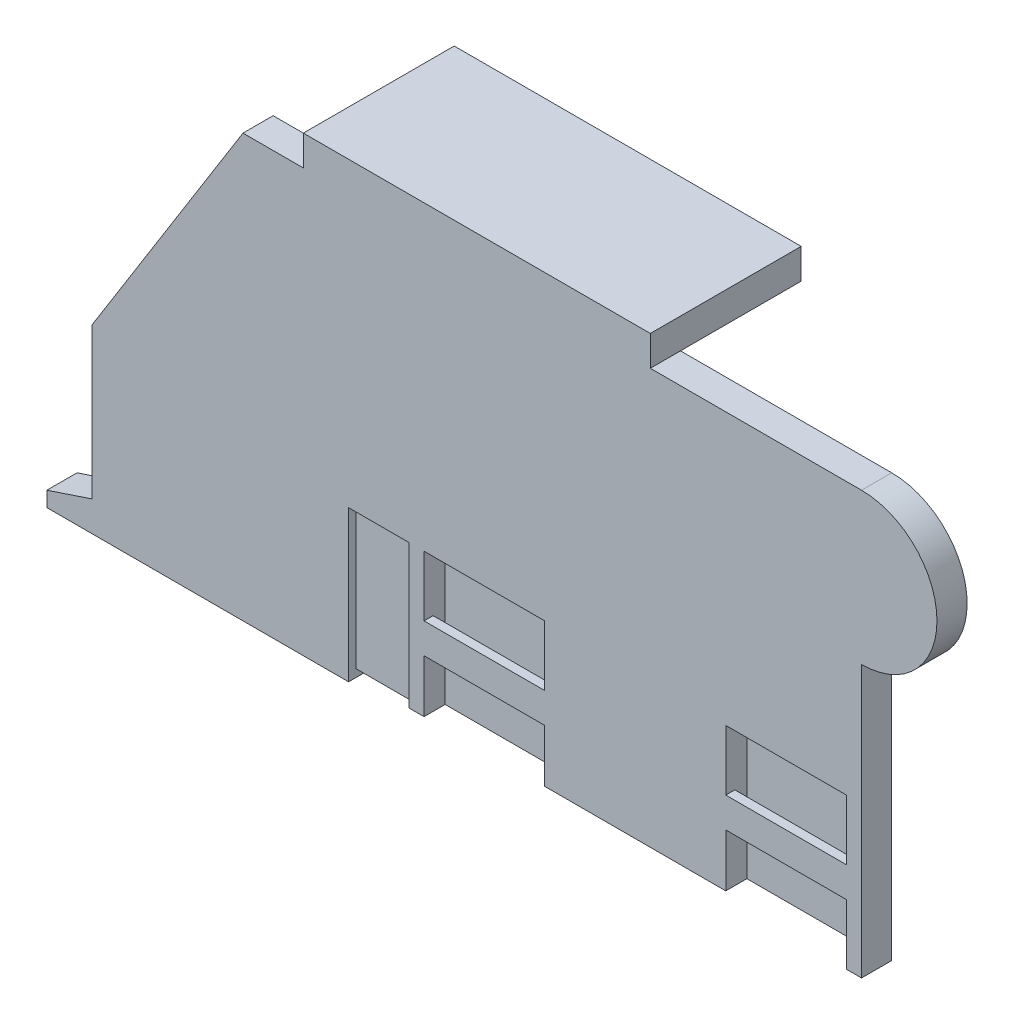
ISO-10303-21;
HEADER;
FILE_DESCRIPTION(('STEP AP214'),'2;1');
FILE_NAME('part.step','',(''),(''),'','','');
FILE_SCHEMA(('AUTOMOTIVE_DESIGN { 1 0 10303 214 1 1 1 1 }'));
ENDSEC;
DATA;
#1=APPLICATION_CONTEXT('core data for automotive mechanical design processes');
#2=APPLICATION_PROTOCOL_DEFINITION('international standard','automotive_design',2000,#1);
#3=PRODUCT_CONTEXT('',#1,'mechanical');
#4=PRODUCT('Part','Part','',(#3));
#5=PRODUCT_RELATED_PRODUCT_CATEGORY('part','',(#4));
#6=PRODUCT_DEFINITION_FORMATION('','',#4);
#7=PRODUCT_DEFINITION_CONTEXT('part definition',#1,'design');
#8=PRODUCT_DEFINITION('design','',#6,#7);
#9=PRODUCT_DEFINITION_SHAPE('','',#8);
#10=(LENGTH_UNIT() NAMED_UNIT(*) SI_UNIT(.MILLI.,.METRE.));
#11=(NAMED_UNIT(*) PLANE_ANGLE_UNIT() SI_UNIT($,.RADIAN.));
#12=(NAMED_UNIT(*) SI_UNIT($,.STERADIAN.) SOLID_ANGLE_UNIT());
#13=UNCERTAINTY_MEASURE_WITH_UNIT(LENGTH_MEASURE(1.E-05),#10,'distance_accuracy_value','');
#14=(GEOMETRIC_REPRESENTATION_CONTEXT(3) GLOBAL_UNCERTAINTY_ASSIGNED_CONTEXT((#13)) GLOBAL_UNIT_ASSIGNED_CONTEXT((#10,
#11,#12)) REPRESENTATION_CONTEXT('',''));
#15=CARTESIAN_POINT('',(0.,0.,0.));
#16=DIRECTION('',(0.,0.,1.));
#17=DIRECTION('',(1.,0.,0.));
#18=AXIS2_PLACEMENT_3D('',#15,#16,#17);
#19=CARTESIAN_POINT('',(0.,0.,-2.));
#20=DIRECTION('',(0.,-1.,0.));
#21=DIRECTION('',(0.,0.,-1.));
#22=AXIS2_PLACEMENT_3D('',#19,#20,#21);
#23=PLANE('',#22);
#24=DIRECTION('',(1.,0.,0.));
#25=VECTOR('',#24,1.);
#26=CARTESIAN_POINT('',(0.,0.,-2.));
#27=LINE('',#26,#25);
#28=CARTESIAN_POINT('',(0.,0.,-2.));
#29=VERTEX_POINT('',#28);
#30=CARTESIAN_POINT('',(20.,0.,-2.));
#31=VERTEX_POINT('',#30);
#32=EDGE_CURVE('E285',#29,#31,#27,.T.);
#33=ORIENTED_EDGE('',*,*,#32,.T.);
#34=DIRECTION('',(0.,0.,1.));
#35=VECTOR('',#34,1.);
#36=CARTESIAN_POINT('',(20.,0.,-0.5));
#37=LINE('',#36,#35);
#38=CARTESIAN_POINT('',(20.,0.,0.));
#39=VERTEX_POINT('',#38);
#40=EDGE_CURVE('E265',#31,#39,#37,.T.);
#41=ORIENTED_EDGE('',*,*,#40,.T.);
#42=DIRECTION('',(1.,0.,0.));
#43=VECTOR('',#42,1.);
#44=CARTESIAN_POINT('',(0.,0.,0.));
#45=LINE('',#44,#43);
#46=CARTESIAN_POINT('',(0.,0.,0.));
#47=VERTEX_POINT('',#46);
#48=EDGE_CURVE('E322',#47,#39,#45,.T.);
#49=ORIENTED_EDGE('',*,*,#48,.F.);
#50=DIRECTION('',(0.,0.,1.));
#51=VECTOR('',#50,1.);
#52=CARTESIAN_POINT('',(0.,0.,-2.));
#53=LINE('',#52,#51);
#54=EDGE_CURVE('E291',#29,#47,#53,.T.);
#55=ORIENTED_EDGE('',*,*,#54,.F.);
#56=EDGE_LOOP('',(#33,#41,#49,#55));
#57=FACE_BOUND('',#56,.T.);
#58=ADVANCED_FACE('F39',(#57),#23,.T.);
#59=CARTESIAN_POINT('',(54.,28.,-2.));
#60=DIRECTION('',(0.,1.,0.));
#61=DIRECTION('',(-1.,0.,0.));
#62=AXIS2_PLACEMENT_3D('',#59,#60,#61);
#63=PLANE('',#62);
#64=DIRECTION('',(-1.,0.,0.));
#65=VECTOR('',#64,1.);
#66=CARTESIAN_POINT('',(54.,28.,0.));
#67=LINE('',#66,#65);
#68=CARTESIAN_POINT('',(17.,28.,0.));
#69=VERTEX_POINT('',#68);
#70=CARTESIAN_POINT('',(13.,28.,0.));
#71=VERTEX_POINT('',#70);
#72=EDGE_CURVE('E330',#69,#71,#67,.T.);
#73=ORIENTED_EDGE('',*,*,#72,.F.);
#74=DIRECTION('',(0.,0.,1.));
#75=VECTOR('',#74,1.);
#76=CARTESIAN_POINT('',(17.,28.,0.));
#77=LINE('',#76,#75);
#78=CARTESIAN_POINT('',(17.,28.,-2.));
#79=VERTEX_POINT('',#78);
#80=EDGE_CURVE('E381',#79,#69,#77,.T.);
#81=ORIENTED_EDGE('',*,*,#80,.F.);
#82=DIRECTION('',(-1.,0.,0.));
#83=VECTOR('',#82,1.);
#84=CARTESIAN_POINT('',(54.,28.,-2.));
#85=LINE('',#84,#83);
#86=CARTESIAN_POINT('',(13.,28.,-2.));
#87=VERTEX_POINT('',#86);
#88=EDGE_CURVE('E304',#79,#87,#85,.T.);
#89=ORIENTED_EDGE('',*,*,#88,.T.);
#90=DIRECTION('',(0.,0.,1.));
#91=VECTOR('',#90,1.);
#92=CARTESIAN_POINT('',(13.,28.,-2.));
#93=LINE('',#92,#91);
#94=EDGE_CURVE('E348',#87,#71,#93,.T.);
#95=ORIENTED_EDGE('',*,*,#94,.T.);
#96=EDGE_LOOP('',(#73,#81,#89,#95));
#97=FACE_BOUND('',#96,.T.);
#98=ADVANCED_FACE('F378',(#97),#63,.T.);
#99=CARTESIAN_POINT('',(54.,28.,-2.));
#100=VERTEX_POINT('',#99);
#101=CARTESIAN_POINT('',(40.,28.,-2.));
#102=VERTEX_POINT('',#101);
#103=EDGE_CURVE('E305',#100,#102,#85,.T.);
#104=ORIENTED_EDGE('',*,*,#103,.T.);
#105=DIRECTION('',(0.,0.,-1.));
#106=VECTOR('',#105,1.);
#107=CARTESIAN_POINT('',(40.,28.,0.));
#108=LINE('',#107,#106);
#109=CARTESIAN_POINT('',(40.,28.,0.));
#110=VERTEX_POINT('',#109);
#111=EDGE_CURVE('E394',#110,#102,#108,.T.);
#112=ORIENTED_EDGE('',*,*,#111,.F.);
#113=CARTESIAN_POINT('',(54.,28.,0.));
#114=VERTEX_POINT('',#113);
#115=EDGE_CURVE('E331',#114,#110,#67,.T.);
#116=ORIENTED_EDGE('',*,*,#115,.F.);
#117=DIRECTION('',(0.,0.,1.));
#118=VECTOR('',#117,1.);
#119=CARTESIAN_POINT('',(54.,28.,-2.));
#120=LINE('',#119,#118);
#121=EDGE_CURVE('E351',#100,#114,#120,.T.);
#122=ORIENTED_EDGE('',*,*,#121,.F.);
#123=EDGE_LOOP('',(#104,#112,#116,#122));
#124=FACE_BOUND('',#123,.T.);
#125=ADVANCED_FACE('F391',(#124),#63,.T.);
#126=CARTESIAN_POINT('',(0.,0.,-2.));
#127=DIRECTION('',(-1.,0.,0.));
#128=DIRECTION('',(0.,0.,1.));
#129=AXIS2_PLACEMENT_3D('',#126,#127,#128);
#130=PLANE('',#129);
#131=DIRECTION('',(0.,-1.,0.));
#132=VECTOR('',#131,1.);
#133=CARTESIAN_POINT('',(0.,0.,0.));
#134=LINE('',#133,#132);
#135=CARTESIAN_POINT('',(0.,1.,0.));
#136=VERTEX_POINT('',#135);
#137=EDGE_CURVE('E317',#136,#47,#134,.T.);
#138=ORIENTED_EDGE('',*,*,#137,.F.);
#139=DIRECTION('',(0.,0.,1.));
#140=VECTOR('',#139,1.);
#141=CARTESIAN_POINT('',(0.,1.,-2.));
#142=LINE('',#141,#140);
#143=CARTESIAN_POINT('',(0.,1.,-2.));
#144=VERTEX_POINT('',#143);
#145=EDGE_CURVE('E47',#144,#136,#142,.T.);
#146=ORIENTED_EDGE('',*,*,#145,.F.);
#147=DIRECTION('',(0.,-1.,0.));
#148=VECTOR('',#147,1.);
#149=CARTESIAN_POINT('',(0.,0.,-2.));
#150=LINE('',#149,#148);
#151=EDGE_CURVE('E298',#144,#29,#150,.T.);
#152=ORIENTED_EDGE('',*,*,#151,.T.);
#153=ORIENTED_EDGE('',*,*,#54,.T.);
#154=EDGE_LOOP('',(#138,#146,#152,#153));
#155=FACE_BOUND('',#154,.T.);
#156=ADVANCED_FACE('F41',(#155),#130,.T.);
#157=CARTESIAN_POINT('',(0.,1.,-2.));
#158=DIRECTION('',(-0.316227766016838,0.948683298050514,0.));
#159=DIRECTION('',(-0.948683298050514,-0.316227766016838,0.));
#160=AXIS2_PLACEMENT_3D('',#157,#158,#159);
#161=PLANE('',#160);
#162=DIRECTION('',(-0.948683298050514,-0.316227766016838,0.));
#163=VECTOR('',#162,1.);
#164=CARTESIAN_POINT('',(0.,1.,0.));
#165=LINE('',#164,#163);
#166=CARTESIAN_POINT('',(3.,2.,0.));
#167=VERTEX_POINT('',#166);
#168=EDGE_CURVE('E340',#167,#136,#165,.T.);
#169=ORIENTED_EDGE('',*,*,#168,.F.);
#170=DIRECTION('',(0.,0.,1.));
#171=VECTOR('',#170,1.);
#172=CARTESIAN_POINT('',(3.,2.,-2.));
#173=LINE('',#172,#171);
#174=CARTESIAN_POINT('',(3.,2.,-2.));
#175=VERTEX_POINT('',#174);
#176=EDGE_CURVE('E344',#175,#167,#173,.T.);
#177=ORIENTED_EDGE('',*,*,#176,.F.);
#178=DIRECTION('',(-0.948683298050514,-0.316227766016838,0.));
#179=VECTOR('',#178,1.);
#180=CARTESIAN_POINT('',(0.,1.,-2.));
#181=LINE('',#180,#179);
#182=EDGE_CURVE('E314',#175,#144,#181,.T.);
#183=ORIENTED_EDGE('',*,*,#182,.T.);
#184=ORIENTED_EDGE('',*,*,#145,.T.);
#185=EDGE_LOOP('',(#169,#177,#183,#184));
#186=FACE_BOUND('',#185,.T.);
#187=ADVANCED_FACE('F366',(#186),#161,.T.);
#188=CARTESIAN_POINT('',(3.,2.,-2.));
#189=DIRECTION('',(-1.,0.,0.));
#190=DIRECTION('',(0.,0.,1.));
#191=AXIS2_PLACEMENT_3D('',#188,#189,#190);
#192=PLANE('',#191);
#193=DIRECTION('',(0.,-1.,0.));
#194=VECTOR('',#193,1.);
#195=CARTESIAN_POINT('',(3.,2.,0.));
#196=LINE('',#195,#194);
#197=CARTESIAN_POINT('',(3.,12.,0.));
#198=VERTEX_POINT('',#197);
#199=EDGE_CURVE('E337',#198,#167,#196,.T.);
#200=ORIENTED_EDGE('',*,*,#199,.F.);
#201=DIRECTION('',(0.,0.,1.));
#202=VECTOR('',#201,1.);
#203=CARTESIAN_POINT('',(3.,12.,-2.));
#204=LINE('',#203,#202);
#205=CARTESIAN_POINT('',(3.,12.,-2.));
#206=VERTEX_POINT('',#205);
#207=EDGE_CURVE('E346',#206,#198,#204,.T.);
#208=ORIENTED_EDGE('',*,*,#207,.F.);
#209=DIRECTION('',(0.,-1.,0.));
#210=VECTOR('',#209,1.);
#211=CARTESIAN_POINT('',(3.,2.,-2.));
#212=LINE('',#211,#210);
#213=EDGE_CURVE('E311',#206,#175,#212,.T.);
#214=ORIENTED_EDGE('',*,*,#213,.T.);
#215=ORIENTED_EDGE('',*,*,#176,.T.);
#216=EDGE_LOOP('',(#200,#208,#214,#215));
#217=FACE_BOUND('',#216,.T.);
#218=ADVANCED_FACE('F695',(#217),#192,.T.);
#219=CARTESIAN_POINT('',(3.,12.,-2.));
#220=DIRECTION('',(-0.847998304005088,0.52999894000318,0.));
#221=DIRECTION('',(-0.52999894000318,-0.847998304005088,0.));
#222=AXIS2_PLACEMENT_3D('',#219,#220,#221);
#223=PLANE('',#222);
#224=DIRECTION('',(-0.52999894000318,-0.847998304005088,0.));
#225=VECTOR('',#224,1.);
#226=CARTESIAN_POINT('',(3.,12.,0.));
#227=LINE('',#226,#225);
#228=EDGE_CURVE('E334',#71,#198,#227,.T.);
#229=ORIENTED_EDGE('',*,*,#228,.F.);
#230=ORIENTED_EDGE('',*,*,#94,.F.);
#231=DIRECTION('',(-0.52999894000318,-0.847998304005088,0.));
#232=VECTOR('',#231,1.);
#233=CARTESIAN_POINT('',(3.,12.,-2.));
#234=LINE('',#233,#232);
#235=EDGE_CURVE('E308',#87,#206,#234,.T.);
#236=ORIENTED_EDGE('',*,*,#235,.T.);
#237=ORIENTED_EDGE('',*,*,#207,.T.);
#238=EDGE_LOOP('',(#229,#230,#236,#237));
#239=FACE_BOUND('',#238,.T.);
#240=ADVANCED_FACE('F375',(#239),#223,.T.);
#241=CARTESIAN_POINT('',(54.,23.,-2.));
#242=DIRECTION('',(0.,0.,1.));
#243=DIRECTION('',(1.,0.,0.));
#244=AXIS2_PLACEMENT_3D('',#241,#242,#243);
#245=CYLINDRICAL_SURFACE('',#244,5.);
#246=CARTESIAN_POINT('',(54.,23.,0.));
#247=DIRECTION('',(0.,0.,1.));
#248=DIRECTION('',(1.,0.,0.));
#249=AXIS2_PLACEMENT_3D('',#246,#247,#248);
#250=CIRCLE('',#249,5.);
#251=CARTESIAN_POINT('',(54.,18.,0.));
#252=VERTEX_POINT('',#251);
#253=EDGE_CURVE('E327',#252,#114,#250,.T.);
#254=ORIENTED_EDGE('',*,*,#253,.F.);
#255=DIRECTION('',(0.,0.,1.));
#256=VECTOR('',#255,1.);
#257=CARTESIAN_POINT('',(54.,18.,-2.));
#258=LINE('',#257,#256);
#259=CARTESIAN_POINT('',(54.,18.,-2.));
#260=VERTEX_POINT('',#259);
#261=EDGE_CURVE('E353',#260,#252,#258,.T.);
#262=ORIENTED_EDGE('',*,*,#261,.F.);
#263=CARTESIAN_POINT('',(54.,23.,-2.));
#264=DIRECTION('',(0.,0.,1.));
#265=DIRECTION('',(1.,0.,0.));
#266=AXIS2_PLACEMENT_3D('',#263,#264,#265);
#267=CIRCLE('',#266,5.);
#268=EDGE_CURVE('E296',#260,#100,#267,.T.);
#269=ORIENTED_EDGE('',*,*,#268,.T.);
#270=ORIENTED_EDGE('',*,*,#121,.T.);
#271=EDGE_LOOP('',(#254,#262,#269,#270));
#272=FACE_BOUND('',#271,.T.);
#273=ADVANCED_FACE('F397',(#272),#245,.T.);
#274=CARTESIAN_POINT('',(54.,0.,-2.));
#275=DIRECTION('',(1.,0.,0.));
#276=DIRECTION('',(0.,0.,-1.));
#277=AXIS2_PLACEMENT_3D('',#274,#275,#276);
#278=PLANE('',#277);
#279=DIRECTION('',(0.,1.,0.));
#280=VECTOR('',#279,1.);
#281=CARTESIAN_POINT('',(54.,0.,0.));
#282=LINE('',#281,#280);
#283=CARTESIAN_POINT('',(54.,0.,0.));
#284=VERTEX_POINT('',#283);
#285=EDGE_CURVE('E324',#284,#252,#282,.T.);
#286=ORIENTED_EDGE('',*,*,#285,.F.);
#287=DIRECTION('',(0.,0.,1.));
#288=VECTOR('',#287,1.);
#289=CARTESIAN_POINT('',(54.,0.,-2.));
#290=LINE('',#289,#288);
#291=CARTESIAN_POINT('',(54.,0.,-2.));
#292=VERTEX_POINT('',#291);
#293=EDGE_CURVE('E355',#292,#284,#290,.T.);
#294=ORIENTED_EDGE('',*,*,#293,.F.);
#295=DIRECTION('',(0.,1.,0.));
#296=VECTOR('',#295,1.);
#297=CARTESIAN_POINT('',(54.,0.,-2.));
#298=LINE('',#297,#296);
#299=EDGE_CURVE('E292',#292,#260,#298,.T.);
#300=ORIENTED_EDGE('',*,*,#299,.T.);
#301=ORIENTED_EDGE('',*,*,#261,.T.);
#302=EDGE_LOOP('',(#286,#294,#300,#301));
#303=FACE_BOUND('',#302,.T.);
#304=ADVANCED_FACE('F403',(#303),#278,.T.);
#305=DIRECTION('',(0.,0.,1.));
#306=VECTOR('',#305,1.);
#307=CARTESIAN_POINT('',(53.,0.,-0.6));
#308=LINE('',#307,#306);
#309=CARTESIAN_POINT('',(53.,0.,-2.));
#310=VERTEX_POINT('',#309);
#311=CARTESIAN_POINT('',(53.,0.,0.));
#312=VERTEX_POINT('',#311);
#313=EDGE_CURVE('E407',#310,#312,#308,.T.);
#314=ORIENTED_EDGE('',*,*,#313,.F.);
#315=EDGE_CURVE('E293',#310,#292,#27,.T.);
#316=ORIENTED_EDGE('',*,*,#315,.T.);
#317=ORIENTED_EDGE('',*,*,#293,.T.);
#318=EDGE_CURVE('E320',#312,#284,#45,.T.);
#319=ORIENTED_EDGE('',*,*,#318,.F.);
#320=EDGE_LOOP('',(#314,#316,#317,#319));
#321=FACE_BOUND('',#320,.T.);
#322=ADVANCED_FACE('F406',(#321),#23,.T.);
#323=CARTESIAN_POINT('',(54.,23.,-2.));
#324=DIRECTION('',(0.,0.,1.));
#325=DIRECTION('',(1.,0.,0.));
#326=AXIS2_PLACEMENT_3D('',#323,#324,#325);
#327=PLANE('',#326);
#328=DIRECTION('',(-1.,0.,0.));
#329=VECTOR('',#328,1.);
#330=CARTESIAN_POINT('',(54.,0.5,-2.));
#331=LINE('',#330,#329);
#332=CARTESIAN_POINT('',(53.,0.5,-2.));
#333=VERTEX_POINT('',#332);
#334=CARTESIAN_POINT('',(20.,0.5,-2.));
#335=VERTEX_POINT('',#334);
#336=EDGE_CURVE('E288',#333,#335,#331,.T.);
#337=ORIENTED_EDGE('',*,*,#336,.T.);
#338=DIRECTION('',(0.,-1.,0.));
#339=VECTOR('',#338,1.);
#340=CARTESIAN_POINT('',(20.,23.,-2.));
#341=LINE('',#340,#339);
#342=EDGE_CURVE('E269',#335,#31,#341,.T.);
#343=ORIENTED_EDGE('',*,*,#342,.T.);
#344=ORIENTED_EDGE('',*,*,#32,.F.);
#345=ORIENTED_EDGE('',*,*,#151,.F.);
#346=ORIENTED_EDGE('',*,*,#182,.F.);
#347=ORIENTED_EDGE('',*,*,#213,.F.);
#348=ORIENTED_EDGE('',*,*,#235,.F.);
#349=ORIENTED_EDGE('',*,*,#88,.F.);
#350=DIRECTION('',(1.,0.,0.));
#351=VECTOR('',#350,1.);
#352=CARTESIAN_POINT('',(54.,28.,-2.));
#353=LINE('',#352,#351);
#354=EDGE_CURVE('E321',#79,#102,#353,.T.);
#355=ORIENTED_EDGE('',*,*,#354,.T.);
#356=ORIENTED_EDGE('',*,*,#103,.F.);
#357=ORIENTED_EDGE('',*,*,#268,.F.);
#358=ORIENTED_EDGE('',*,*,#299,.F.);
#359=ORIENTED_EDGE('',*,*,#315,.F.);
#360=DIRECTION('',(0.,1.,0.));
#361=VECTOR('',#360,1.);
#362=CARTESIAN_POINT('',(53.0000000000003,23.,-2.));
#363=LINE('',#362,#361);
#364=EDGE_CURVE('E289',#310,#333,#363,.T.);
#365=ORIENTED_EDGE('',*,*,#364,.T.);
#366=EDGE_LOOP('',(#337,#343,#344,#345,#346,#347,#348,#349,#355,#356,#357,#358,#359,#365));
#367=FACE_BOUND('',#366,.T.);
#368=ADVANCED_FACE('F283',(#367),#327,.F.);
#369=CARTESIAN_POINT('',(54.,23.,0.));
#370=DIRECTION('',(0.,0.,1.));
#371=DIRECTION('',(1.,0.,0.));
#372=AXIS2_PLACEMENT_3D('',#369,#370,#371);
#373=PLANE('',#372);
#374=DIRECTION('',(-1.,0.,0.));
#375=VECTOR('',#374,1.);
#376=CARTESIAN_POINT('',(20.,0.5,0.));
#377=LINE('',#376,#375);
#378=CARTESIAN_POINT('',(45.,0.5,0.));
#379=VERTEX_POINT('',#378);
#380=CARTESIAN_POINT('',(33.,0.5,0.));
#381=VERTEX_POINT('',#380);
#382=EDGE_CURVE('E652',#379,#381,#377,.T.);
#383=ORIENTED_EDGE('',*,*,#382,.F.);
#384=DIRECTION('',(0.,-1.,0.));
#385=VECTOR('',#384,1.);
#386=CARTESIAN_POINT('',(45.,0.,0.));
#387=LINE('',#386,#385);
#388=CARTESIAN_POINT('',(45.,4.,0.));
#389=VERTEX_POINT('',#388);
#390=EDGE_CURVE('E463',#389,#379,#387,.T.);
#391=ORIENTED_EDGE('',*,*,#390,.F.);
#392=DIRECTION('',(-1.,0.,0.));
#393=VECTOR('',#392,1.);
#394=CARTESIAN_POINT('',(45.,4.,0.));
#395=LINE('',#394,#393);
#396=CARTESIAN_POINT('',(53.,4.,0.));
#397=VERTEX_POINT('',#396);
#398=EDGE_CURVE('E479',#397,#389,#395,.T.);
#399=ORIENTED_EDGE('',*,*,#398,.F.);
#400=DIRECTION('',(0.,1.,0.));
#401=VECTOR('',#400,1.);
#402=CARTESIAN_POINT('',(53.,0.,0.));
#403=LINE('',#402,#401);
#404=EDGE_CURVE('E477',#312,#397,#403,.T.);
#405=ORIENTED_EDGE('',*,*,#404,.F.);
#406=ORIENTED_EDGE('',*,*,#318,.T.);
#407=ORIENTED_EDGE('',*,*,#285,.T.);
#408=ORIENTED_EDGE('',*,*,#253,.T.);
#409=ORIENTED_EDGE('',*,*,#115,.T.);
#410=DIRECTION('',(0.,-1.,0.));
#411=VECTOR('',#410,1.);
#412=CARTESIAN_POINT('',(40.,30.,0.));
#413=LINE('',#412,#411);
#414=CARTESIAN_POINT('',(40.,30.,0.));
#415=VERTEX_POINT('',#414);
#416=EDGE_CURVE('E559',#415,#110,#413,.T.);
#417=ORIENTED_EDGE('',*,*,#416,.F.);
#418=DIRECTION('',(1.,0.,0.));
#419=VECTOR('',#418,1.);
#420=CARTESIAN_POINT('',(17.,30.,0.));
#421=LINE('',#420,#419);
#422=CARTESIAN_POINT('',(17.,30.,0.));
#423=VERTEX_POINT('',#422);
#424=EDGE_CURVE('E541',#423,#415,#421,.T.);
#425=ORIENTED_EDGE('',*,*,#424,.F.);
#426=DIRECTION('',(0.,-1.,0.));
#427=VECTOR('',#426,1.);
#428=CARTESIAN_POINT('',(17.,30.,0.));
#429=LINE('',#428,#427);
#430=EDGE_CURVE('E388',#423,#69,#429,.T.);
#431=ORIENTED_EDGE('',*,*,#430,.T.);
#432=ORIENTED_EDGE('',*,*,#72,.T.);
#433=ORIENTED_EDGE('',*,*,#228,.T.);
#434=ORIENTED_EDGE('',*,*,#199,.T.);
#435=ORIENTED_EDGE('',*,*,#168,.T.);
#436=ORIENTED_EDGE('',*,*,#137,.T.);
#437=ORIENTED_EDGE('',*,*,#48,.T.);
#438=DIRECTION('',(0.,-1.,0.));
#439=VECTOR('',#438,1.);
#440=CARTESIAN_POINT('',(20.,0.,0.));
#441=LINE('',#440,#439);
#442=CARTESIAN_POINT('',(20.,10.,0.));
#443=VERTEX_POINT('',#442);
#444=EDGE_CURVE('E272',#443,#39,#441,.T.);
#445=ORIENTED_EDGE('',*,*,#444,.F.);
#446=DIRECTION('',(-1.,0.,0.));
#447=VECTOR('',#446,1.);
#448=CARTESIAN_POINT('',(24.,10.,0.));
#449=LINE('',#448,#447);
#450=CARTESIAN_POINT('',(24.,10.,0.));
#451=VERTEX_POINT('',#450);
#452=EDGE_CURVE('E412',#451,#443,#449,.T.);
#453=ORIENTED_EDGE('',*,*,#452,.F.);
#454=DIRECTION('',(0.,1.,0.));
#455=VECTOR('',#454,1.);
#456=CARTESIAN_POINT('',(24.,0.,0.));
#457=LINE('',#456,#455);
#458=CARTESIAN_POINT('',(24.,0.5,0.));
#459=VERTEX_POINT('',#458);
#460=EDGE_CURVE('E60',#459,#451,#457,.T.);
#461=ORIENTED_EDGE('',*,*,#460,.F.);
#462=CARTESIAN_POINT('',(25.,0.5,0.));
#463=VERTEX_POINT('',#462);
#464=EDGE_CURVE('E650',#463,#459,#377,.T.);
#465=ORIENTED_EDGE('',*,*,#464,.F.);
#466=DIRECTION('',(0.,-1.,0.));
#467=VECTOR('',#466,1.);
#468=CARTESIAN_POINT('',(25.,0.,0.));
#469=LINE('',#468,#467);
#470=CARTESIAN_POINT('',(25.,4.,0.));
#471=VERTEX_POINT('',#470);
#472=EDGE_CURVE('E452',#471,#463,#469,.T.);
#473=ORIENTED_EDGE('',*,*,#472,.F.);
#474=DIRECTION('',(-1.,0.,0.));
#475=VECTOR('',#474,1.);
#476=CARTESIAN_POINT('',(25.,4.,0.));
#477=LINE('',#476,#475);
#478=CARTESIAN_POINT('',(33.,4.,0.));
#479=VERTEX_POINT('',#478);
#480=EDGE_CURVE('E467',#479,#471,#477,.T.);
#481=ORIENTED_EDGE('',*,*,#480,.F.);
#482=DIRECTION('',(0.,1.,0.));
#483=VECTOR('',#482,1.);
#484=CARTESIAN_POINT('',(33.,0.,0.));
#485=LINE('',#484,#483);
#486=EDGE_CURVE('E471',#381,#479,#485,.T.);
#487=ORIENTED_EDGE('',*,*,#486,.F.);
#488=EDGE_LOOP('',(#383,#391,#399,#405,#406,#407,#408,#409,#417,#425,#431,#432,#433,#434,#435,
#436,#437,#445,#453,#461,#465,#473,#481,#487));
#489=FACE_BOUND('',#488,.T.);
#490=DIRECTION('',(0.,-1.,0.));
#491=VECTOR('',#490,1.);
#492=CARTESIAN_POINT('',(45.,10.,0.));
#493=LINE('',#492,#491);
#494=CARTESIAN_POINT('',(45.,10.,0.));
#495=VERTEX_POINT('',#494);
#496=CARTESIAN_POINT('',(45.,6.,0.));
#497=VERTEX_POINT('',#496);
#498=EDGE_CURVE('E461',#495,#497,#493,.T.);
#499=ORIENTED_EDGE('',*,*,#498,.F.);
#500=DIRECTION('',(-1.,0.,0.));
#501=VECTOR('',#500,1.);
#502=CARTESIAN_POINT('',(45.,10.,0.));
#503=LINE('',#502,#501);
#504=CARTESIAN_POINT('',(53.,10.,0.));
#505=VERTEX_POINT('',#504);
#506=EDGE_CURVE('E449',#505,#495,#503,.T.);
#507=ORIENTED_EDGE('',*,*,#506,.F.);
#508=DIRECTION('',(0.,1.,0.));
#509=VECTOR('',#508,1.);
#510=CARTESIAN_POINT('',(53.,10.,0.));
#511=LINE('',#510,#509);
#512=CARTESIAN_POINT('',(53.,6.,0.));
#513=VERTEX_POINT('',#512);
#514=EDGE_CURVE('E455',#513,#505,#511,.T.);
#515=ORIENTED_EDGE('',*,*,#514,.F.);
#516=DIRECTION('',(1.,0.,0.));
#517=VECTOR('',#516,1.);
#518=CARTESIAN_POINT('',(45.,6.,0.));
#519=LINE('',#518,#517);
#520=EDGE_CURVE('E458',#497,#513,#519,.T.);
#521=ORIENTED_EDGE('',*,*,#520,.F.);
#522=EDGE_LOOP('',(#499,#507,#515,#521));
#523=FACE_BOUND('',#522,.T.);
#524=DIRECTION('',(0.,-1.,0.));
#525=VECTOR('',#524,1.);
#526=CARTESIAN_POINT('',(25.,10.,0.));
#527=LINE('',#526,#525);
#528=CARTESIAN_POINT('',(25.,10.,0.));
#529=VERTEX_POINT('',#528);
#530=CARTESIAN_POINT('',(25.,6.,0.));
#531=VERTEX_POINT('',#530);
#532=EDGE_CURVE('E443',#529,#531,#527,.T.);
#533=ORIENTED_EDGE('',*,*,#532,.F.);
#534=DIRECTION('',(-1.,0.,0.));
#535=VECTOR('',#534,1.);
#536=CARTESIAN_POINT('',(25.,10.,0.));
#537=LINE('',#536,#535);
#538=CARTESIAN_POINT('',(33.,10.,0.));
#539=VERTEX_POINT('',#538);
#540=EDGE_CURVE('E433',#539,#529,#537,.T.);
#541=ORIENTED_EDGE('',*,*,#540,.F.);
#542=DIRECTION('',(0.,1.,0.));
#543=VECTOR('',#542,1.);
#544=CARTESIAN_POINT('',(33.,10.,0.));
#545=LINE('',#544,#543);
#546=CARTESIAN_POINT('',(33.,6.,0.));
#547=VERTEX_POINT('',#546);
#548=EDGE_CURVE('E437',#547,#539,#545,.T.);
#549=ORIENTED_EDGE('',*,*,#548,.F.);
#550=DIRECTION('',(1.,0.,0.));
#551=VECTOR('',#550,1.);
#552=CARTESIAN_POINT('',(25.,6.,0.));
#553=LINE('',#552,#551);
#554=EDGE_CURVE('E440',#531,#547,#553,.T.);
#555=ORIENTED_EDGE('',*,*,#554,.F.);
#556=EDGE_LOOP('',(#533,#541,#549,#555));
#557=FACE_BOUND('',#556,.T.);
#558=ADVANCED_FACE('F361',(#489,#523,#557),#373,.T.);
#559=CARTESIAN_POINT('',(0.,28.,0.));
#560=DIRECTION('',(0.,-1.,0.));
#561=DIRECTION('',(1.,0.,0.));
#562=AXIS2_PLACEMENT_3D('',#559,#560,#561);
#563=PLANE('',#562);
#564=ORIENTED_EDGE('',*,*,#354,.F.);
#565=CARTESIAN_POINT('',(17.,28.,-10.));
#566=VERTEX_POINT('',#565);
#567=EDGE_CURVE('E549',#566,#79,#77,.T.);
#568=ORIENTED_EDGE('',*,*,#567,.F.);
#569=DIRECTION('',(-1.,0.,0.));
#570=VECTOR('',#569,1.);
#571=CARTESIAN_POINT('',(17.,28.,-10.));
#572=LINE('',#571,#570);
#573=CARTESIAN_POINT('',(40.,28.,-10.));
#574=VERTEX_POINT('',#573);
#575=EDGE_CURVE('E542',#574,#566,#572,.T.);
#576=ORIENTED_EDGE('',*,*,#575,.F.);
#577=EDGE_CURVE('E551',#102,#574,#108,.T.);
#578=ORIENTED_EDGE('',*,*,#577,.F.);
#579=EDGE_LOOP('',(#564,#568,#576,#578));
#580=FACE_BOUND('',#579,.T.);
#581=ADVANCED_FACE('F568',(#580),#563,.T.);
#582=CARTESIAN_POINT('',(17.,30.,0.));
#583=DIRECTION('',(1.,0.,0.));
#584=DIRECTION('',(0.,1.,0.));
#585=AXIS2_PLACEMENT_3D('',#582,#583,#584);
#586=PLANE('',#585);
#587=ORIENTED_EDGE('',*,*,#567,.T.);
#588=ORIENTED_EDGE('',*,*,#80,.T.);
#589=ORIENTED_EDGE('',*,*,#430,.F.);
#590=DIRECTION('',(0.,0.,1.));
#591=VECTOR('',#590,1.);
#592=CARTESIAN_POINT('',(17.,30.,0.));
#593=LINE('',#592,#591);
#594=CARTESIAN_POINT('',(17.,30.,-10.));
#595=VERTEX_POINT('',#594);
#596=EDGE_CURVE('E538',#595,#423,#593,.T.);
#597=ORIENTED_EDGE('',*,*,#596,.F.);
#598=DIRECTION('',(0.,-1.,0.));
#599=VECTOR('',#598,1.);
#600=CARTESIAN_POINT('',(17.,30.,-10.));
#601=LINE('',#600,#599);
#602=EDGE_CURVE('E548',#595,#566,#601,.T.);
#603=ORIENTED_EDGE('',*,*,#602,.T.);
#604=EDGE_LOOP('',(#587,#588,#589,#597,#603));
#605=FACE_BOUND('',#604,.T.);
#606=ADVANCED_FACE('F565',(#605),#586,.F.);
#607=CARTESIAN_POINT('',(40.,30.,0.));
#608=DIRECTION('',(-1.,0.,0.));
#609=DIRECTION('',(0.,-1.,0.));
#610=AXIS2_PLACEMENT_3D('',#607,#608,#609);
#611=PLANE('',#610);
#612=ORIENTED_EDGE('',*,*,#111,.T.);
#613=ORIENTED_EDGE('',*,*,#577,.T.);
#614=DIRECTION('',(0.,-1.,0.));
#615=VECTOR('',#614,1.);
#616=CARTESIAN_POINT('',(40.,30.,-10.));
#617=LINE('',#616,#615);
#618=CARTESIAN_POINT('',(40.,30.,-10.));
#619=VERTEX_POINT('',#618);
#620=EDGE_CURVE('E556',#619,#574,#617,.T.);
#621=ORIENTED_EDGE('',*,*,#620,.F.);
#622=DIRECTION('',(0.,0.,-1.));
#623=VECTOR('',#622,1.);
#624=CARTESIAN_POINT('',(40.,30.,0.));
#625=LINE('',#624,#623);
#626=EDGE_CURVE('E544',#415,#619,#625,.T.);
#627=ORIENTED_EDGE('',*,*,#626,.F.);
#628=ORIENTED_EDGE('',*,*,#416,.T.);
#629=EDGE_LOOP('',(#612,#613,#621,#627,#628));
#630=FACE_BOUND('',#629,.T.);
#631=ADVANCED_FACE('F575',(#630),#611,.F.);
#632=CARTESIAN_POINT('',(17.,30.,-10.));
#633=DIRECTION('',(0.,0.,1.));
#634=DIRECTION('',(1.,0.,0.));
#635=AXIS2_PLACEMENT_3D('',#632,#633,#634);
#636=PLANE('',#635);
#637=ORIENTED_EDGE('',*,*,#575,.T.);
#638=ORIENTED_EDGE('',*,*,#602,.F.);
#639=DIRECTION('',(-1.,0.,0.));
#640=VECTOR('',#639,1.);
#641=CARTESIAN_POINT('',(17.,30.,-10.));
#642=LINE('',#641,#640);
#643=EDGE_CURVE('E546',#619,#595,#642,.T.);
#644=ORIENTED_EDGE('',*,*,#643,.F.);
#645=ORIENTED_EDGE('',*,*,#620,.T.);
#646=EDGE_LOOP('',(#637,#638,#644,#645));
#647=FACE_BOUND('',#646,.T.);
#648=ADVANCED_FACE('F570',(#647),#636,.F.);
#649=CARTESIAN_POINT('',(0.,30.,0.));
#650=DIRECTION('',(0.,-1.,0.));
#651=DIRECTION('',(1.,0.,0.));
#652=AXIS2_PLACEMENT_3D('',#649,#650,#651);
#653=PLANE('',#652);
#654=ORIENTED_EDGE('',*,*,#596,.T.);
#655=ORIENTED_EDGE('',*,*,#424,.T.);
#656=ORIENTED_EDGE('',*,*,#626,.T.);
#657=ORIENTED_EDGE('',*,*,#643,.T.);
#658=EDGE_LOOP('',(#654,#655,#656,#657));
#659=FACE_BOUND('',#658,.T.);
#660=ADVANCED_FACE('F708',(#659),#653,.F.);
#661=CARTESIAN_POINT('',(25.,10.,-0.6));
#662=DIRECTION('',(-1.,0.,0.));
#663=DIRECTION('',(0.,0.,1.));
#664=AXIS2_PLACEMENT_3D('',#661,#662,#663);
#665=PLANE('',#664);
#666=ORIENTED_EDGE('',*,*,#472,.T.);
#667=DIRECTION('',(0.,0.,-1.));
#668=VECTOR('',#667,1.);
#669=CARTESIAN_POINT('',(25.,0.5,-0.6));
#670=LINE('',#669,#668);
#671=CARTESIAN_POINT('',(25.,0.5,-1.4));
#672=VERTEX_POINT('',#671);
#673=EDGE_CURVE('E619',#463,#672,#670,.T.);
#674=ORIENTED_EDGE('',*,*,#673,.T.);
#675=DIRECTION('',(0.,-1.,0.));
#676=VECTOR('',#675,1.);
#677=CARTESIAN_POINT('',(25.,10.,-1.4));
#678=LINE('',#677,#676);
#679=CARTESIAN_POINT('',(25.,10.,-1.4));
#680=VERTEX_POINT('',#679);
#681=EDGE_CURVE('E521',#680,#672,#678,.T.);
#682=ORIENTED_EDGE('',*,*,#681,.F.);
#683=DIRECTION('',(0.,0.,-1.));
#684=VECTOR('',#683,1.);
#685=CARTESIAN_POINT('',(25.,10.,-0.6));
#686=LINE('',#685,#684);
#687=EDGE_CURVE('E509',#529,#680,#686,.T.);
#688=ORIENTED_EDGE('',*,*,#687,.F.);
#689=ORIENTED_EDGE('',*,*,#532,.T.);
#690=DIRECTION('',(0.,0.,1.));
#691=VECTOR('',#690,1.);
#692=CARTESIAN_POINT('',(25.,6.,-1.));
#693=LINE('',#692,#691);
#694=CARTESIAN_POINT('',(25.,6.,-0.6));
#695=VERTEX_POINT('',#694);
#696=EDGE_CURVE('E430',#695,#531,#693,.T.);
#697=ORIENTED_EDGE('',*,*,#696,.F.);
#698=DIRECTION('',(0.,-1.,0.));
#699=VECTOR('',#698,1.);
#700=CARTESIAN_POINT('',(25.,10.,-0.6));
#701=LINE('',#700,#699);
#702=CARTESIAN_POINT('',(25.,4.,-0.6));
#703=VERTEX_POINT('',#702);
#704=EDGE_CURVE('E499',#695,#703,#701,.T.);
#705=ORIENTED_EDGE('',*,*,#704,.T.);
#706=DIRECTION('',(0.,0.,1.));
#707=VECTOR('',#706,1.);
#708=CARTESIAN_POINT('',(25.,4.,-1.));
#709=LINE('',#708,#707);
#710=EDGE_CURVE('E445',#703,#471,#709,.T.);
#711=ORIENTED_EDGE('',*,*,#710,.T.);
#712=EDGE_LOOP('',(#666,#674,#682,#688,#689,#697,#705,#711));
#713=FACE_BOUND('',#712,.T.);
#714=ADVANCED_FACE('F623',(#713),#665,.F.);
#715=CARTESIAN_POINT('',(25.,10.,-0.6));
#716=DIRECTION('',(0.,0.,1.));
#717=DIRECTION('',(1.,0.,0.));
#718=AXIS2_PLACEMENT_3D('',#715,#716,#717);
#719=PLANE('',#718);
#720=DIRECTION('',(0.,-1.,0.));
#721=VECTOR('',#720,1.);
#722=CARTESIAN_POINT('',(33.,10.,-0.6));
#723=LINE('',#722,#721);
#724=CARTESIAN_POINT('',(33.,6.,-0.6));
#725=VERTEX_POINT('',#724);
#726=CARTESIAN_POINT('',(33.,4.,-0.6));
#727=VERTEX_POINT('',#726);
#728=EDGE_CURVE('E528',#725,#727,#723,.T.);
#729=ORIENTED_EDGE('',*,*,#728,.T.);
#730=DIRECTION('',(-1.,0.,0.));
#731=VECTOR('',#730,1.);
#732=CARTESIAN_POINT('',(25.,4.,-0.6));
#733=LINE('',#732,#731);
#734=EDGE_CURVE('E496',#727,#703,#733,.T.);
#735=ORIENTED_EDGE('',*,*,#734,.T.);
#736=ORIENTED_EDGE('',*,*,#704,.F.);
#737=DIRECTION('',(1.,0.,0.));
#738=VECTOR('',#737,1.);
#739=CARTESIAN_POINT('',(25.,6.,-0.6));
#740=LINE('',#739,#738);
#741=EDGE_CURVE('E493',#695,#725,#740,.T.);
#742=ORIENTED_EDGE('',*,*,#741,.T.);
#743=EDGE_LOOP('',(#729,#735,#736,#742));
#744=FACE_BOUND('',#743,.T.);
#745=ADVANCED_FACE('F644',(#744),#719,.F.);
#746=CARTESIAN_POINT('',(33.,10.,-0.6));
#747=DIRECTION('',(1.,0.,0.));
#748=DIRECTION('',(0.,0.,-1.));
#749=AXIS2_PLACEMENT_3D('',#746,#747,#748);
#750=PLANE('',#749);
#751=DIRECTION('',(0.,-1.,0.));
#752=VECTOR('',#751,1.);
#753=CARTESIAN_POINT('',(33.,10.,-1.4));
#754=LINE('',#753,#752);
#755=CARTESIAN_POINT('',(33.,10.,-1.4));
#756=VERTEX_POINT('',#755);
#757=CARTESIAN_POINT('',(33.,0.5,-1.4));
#758=VERTEX_POINT('',#757);
#759=EDGE_CURVE('E525',#756,#758,#754,.T.);
#760=ORIENTED_EDGE('',*,*,#759,.T.);
#761=DIRECTION('',(0.,0.,1.));
#762=VECTOR('',#761,1.);
#763=CARTESIAN_POINT('',(33.,0.5,-0.6));
#764=LINE('',#763,#762);
#765=EDGE_CURVE('E616',#758,#381,#764,.T.);
#766=ORIENTED_EDGE('',*,*,#765,.T.);
#767=ORIENTED_EDGE('',*,*,#486,.T.);
#768=DIRECTION('',(0.,0.,1.));
#769=VECTOR('',#768,1.);
#770=CARTESIAN_POINT('',(33.,4.,-1.));
#771=LINE('',#770,#769);
#772=EDGE_CURVE('E464',#727,#479,#771,.T.);
#773=ORIENTED_EDGE('',*,*,#772,.F.);
#774=ORIENTED_EDGE('',*,*,#728,.F.);
#775=DIRECTION('',(0.,0.,1.));
#776=VECTOR('',#775,1.);
#777=CARTESIAN_POINT('',(33.,6.,-1.));
#778=LINE('',#777,#776);
#779=EDGE_CURVE('E277',#725,#547,#778,.T.);
#780=ORIENTED_EDGE('',*,*,#779,.T.);
#781=ORIENTED_EDGE('',*,*,#548,.T.);
#782=DIRECTION('',(0.,0.,1.));
#783=VECTOR('',#782,1.);
#784=CARTESIAN_POINT('',(33.,10.,-0.6));
#785=LINE('',#784,#783);
#786=EDGE_CURVE('E524',#756,#539,#785,.T.);
#787=ORIENTED_EDGE('',*,*,#786,.F.);
#788=EDGE_LOOP('',(#760,#766,#767,#773,#774,#780,#781,#787));
#789=FACE_BOUND('',#788,.T.);
#790=ADVANCED_FACE('F641',(#789),#750,.F.);
#791=CARTESIAN_POINT('',(25.,10.,-1.4));
#792=DIRECTION('',(0.,0.,-1.));
#793=DIRECTION('',(-1.,0.,0.));
#794=AXIS2_PLACEMENT_3D('',#791,#792,#793);
#795=PLANE('',#794);
#796=ORIENTED_EDGE('',*,*,#681,.T.);
#797=DIRECTION('',(1.,0.,0.));
#798=VECTOR('',#797,1.);
#799=CARTESIAN_POINT('',(25.,0.5,-1.4));
#800=LINE('',#799,#798);
#801=EDGE_CURVE('E608',#672,#758,#800,.T.);
#802=ORIENTED_EDGE('',*,*,#801,.T.);
#803=ORIENTED_EDGE('',*,*,#759,.F.);
#804=DIRECTION('',(1.,0.,0.));
#805=VECTOR('',#804,1.);
#806=CARTESIAN_POINT('',(25.,10.,-1.4));
#807=LINE('',#806,#805);
#808=EDGE_CURVE('E534',#680,#756,#807,.T.);
#809=ORIENTED_EDGE('',*,*,#808,.F.);
#810=EDGE_LOOP('',(#796,#802,#803,#809));
#811=FACE_BOUND('',#810,.T.);
#812=ADVANCED_FACE('F628',(#811),#795,.F.);
#813=CARTESIAN_POINT('',(0.,10.,0.));
#814=DIRECTION('',(0.,-1.,0.));
#815=DIRECTION('',(0.,0.,-1.));
#816=AXIS2_PLACEMENT_3D('',#813,#814,#815);
#817=PLANE('',#816);
#818=ORIENTED_EDGE('',*,*,#687,.T.);
#819=ORIENTED_EDGE('',*,*,#808,.T.);
#820=ORIENTED_EDGE('',*,*,#786,.T.);
#821=ORIENTED_EDGE('',*,*,#540,.T.);
#822=EDGE_LOOP('',(#818,#819,#820,#821));
#823=FACE_BOUND('',#822,.T.);
#824=ADVANCED_FACE('F631',(#823),#817,.T.);
#825=CARTESIAN_POINT('',(45.,10.,-0.6));
#826=DIRECTION('',(-1.,0.,0.));
#827=DIRECTION('',(0.,0.,1.));
#828=AXIS2_PLACEMENT_3D('',#825,#826,#827);
#829=PLANE('',#828);
#830=ORIENTED_EDGE('',*,*,#390,.T.);
#831=DIRECTION('',(0.,0.,-1.));
#832=VECTOR('',#831,1.);
#833=CARTESIAN_POINT('',(45.,0.5,-0.6));
#834=LINE('',#833,#832);
#835=CARTESIAN_POINT('',(45.,0.5,-1.4));
#836=VERTEX_POINT('',#835);
#837=EDGE_CURVE('E606',#379,#836,#834,.T.);
#838=ORIENTED_EDGE('',*,*,#837,.T.);
#839=DIRECTION('',(0.,-1.,0.));
#840=VECTOR('',#839,1.);
#841=CARTESIAN_POINT('',(45.,10.,-1.4));
#842=LINE('',#841,#840);
#843=CARTESIAN_POINT('',(45.,10.,-1.4));
#844=VERTEX_POINT('',#843);
#845=EDGE_CURVE('E507',#844,#836,#842,.T.);
#846=ORIENTED_EDGE('',*,*,#845,.F.);
#847=DIRECTION('',(0.,0.,-1.));
#848=VECTOR('',#847,1.);
#849=CARTESIAN_POINT('',(45.,10.,-0.6));
#850=LINE('',#849,#848);
#851=EDGE_CURVE('E500',#495,#844,#850,.T.);
#852=ORIENTED_EDGE('',*,*,#851,.F.);
#853=ORIENTED_EDGE('',*,*,#498,.T.);
#854=DIRECTION('',(0.,0.,1.));
#855=VECTOR('',#854,1.);
#856=CARTESIAN_POINT('',(45.,6.,-1.));
#857=LINE('',#856,#855);
#858=CARTESIAN_POINT('',(45.,6.,-0.6));
#859=VERTEX_POINT('',#858);
#860=EDGE_CURVE('E446',#859,#497,#857,.T.);
#861=ORIENTED_EDGE('',*,*,#860,.F.);
#862=DIRECTION('',(0.,-1.,0.));
#863=VECTOR('',#862,1.);
#864=CARTESIAN_POINT('',(45.,10.,-0.6));
#865=LINE('',#864,#863);
#866=CARTESIAN_POINT('',(45.,4.,-0.6));
#867=VERTEX_POINT('',#866);
#868=EDGE_CURVE('E510',#859,#867,#865,.T.);
#869=ORIENTED_EDGE('',*,*,#868,.T.);
#870=DIRECTION('',(0.,0.,1.));
#871=VECTOR('',#870,1.);
#872=CARTESIAN_POINT('',(45.,4.,-1.));
#873=LINE('',#872,#871);
#874=EDGE_CURVE('E483',#867,#389,#873,.T.);
#875=ORIENTED_EDGE('',*,*,#874,.T.);
#876=EDGE_LOOP('',(#830,#838,#846,#852,#853,#861,#869,#875));
#877=FACE_BOUND('',#876,.T.);
#878=ADVANCED_FACE('F716',(#877),#829,.F.);
#879=CARTESIAN_POINT('',(45.,10.,-0.6));
#880=DIRECTION('',(0.,0.,1.));
#881=DIRECTION('',(1.,0.,0.));
#882=AXIS2_PLACEMENT_3D('',#879,#880,#881);
#883=PLANE('',#882);
#884=ORIENTED_EDGE('',*,*,#868,.F.);
#885=DIRECTION('',(1.,0.,0.));
#886=VECTOR('',#885,1.);
#887=CARTESIAN_POINT('',(45.,6.,-0.6));
#888=LINE('',#887,#886);
#889=CARTESIAN_POINT('',(53.,6.,-0.6));
#890=VERTEX_POINT('',#889);
#891=EDGE_CURVE('E490',#859,#890,#888,.T.);
#892=ORIENTED_EDGE('',*,*,#891,.T.);
#893=DIRECTION('',(0.,-1.,0.));
#894=VECTOR('',#893,1.);
#895=CARTESIAN_POINT('',(53.,10.,-0.6));
#896=LINE('',#895,#894);
#897=CARTESIAN_POINT('',(53.,4.,-0.6));
#898=VERTEX_POINT('',#897);
#899=EDGE_CURVE('E513',#890,#898,#896,.T.);
#900=ORIENTED_EDGE('',*,*,#899,.T.);
#901=DIRECTION('',(-1.,0.,0.));
#902=VECTOR('',#901,1.);
#903=CARTESIAN_POINT('',(45.,4.,-0.6));
#904=LINE('',#903,#902);
#905=EDGE_CURVE('E485',#898,#867,#904,.T.);
#906=ORIENTED_EDGE('',*,*,#905,.T.);
#907=EDGE_LOOP('',(#884,#892,#900,#906));
#908=FACE_BOUND('',#907,.T.);
#909=ADVANCED_FACE('F586',(#908),#883,.F.);
#910=CARTESIAN_POINT('',(53.,10.,-0.6));
#911=DIRECTION('',(1.,0.,0.));
#912=DIRECTION('',(0.,0.,-1.));
#913=AXIS2_PLACEMENT_3D('',#910,#911,#912);
#914=PLANE('',#913);
#915=DIRECTION('',(0.,-1.,0.));
#916=VECTOR('',#915,1.);
#917=CARTESIAN_POINT('',(53.,10.,-1.4));
#918=LINE('',#917,#916);
#919=CARTESIAN_POINT('',(53.,10.,-1.4));
#920=VERTEX_POINT('',#919);
#921=CARTESIAN_POINT('',(53.,0.5,-1.4));
#922=VERTEX_POINT('',#921);
#923=EDGE_CURVE('E516',#920,#922,#918,.T.);
#924=ORIENTED_EDGE('',*,*,#923,.T.);
#925=DIRECTION('',(0.,0.,1.));
#926=VECTOR('',#925,1.);
#927=CARTESIAN_POINT('',(53.,0.5,-10.));
#928=LINE('',#927,#926);
#929=EDGE_CURVE('E600',#333,#922,#928,.T.);
#930=ORIENTED_EDGE('',*,*,#929,.F.);
#931=ORIENTED_EDGE('',*,*,#364,.F.);
#932=ORIENTED_EDGE('',*,*,#313,.T.);
#933=ORIENTED_EDGE('',*,*,#404,.T.);
#934=DIRECTION('',(0.,0.,1.));
#935=VECTOR('',#934,1.);
#936=CARTESIAN_POINT('',(53.,4.,-1.));
#937=LINE('',#936,#935);
#938=EDGE_CURVE('E482',#898,#397,#937,.T.);
#939=ORIENTED_EDGE('',*,*,#938,.F.);
#940=ORIENTED_EDGE('',*,*,#899,.F.);
#941=DIRECTION('',(0.,0.,1.));
#942=VECTOR('',#941,1.);
#943=CARTESIAN_POINT('',(53.,6.,-1.));
#944=LINE('',#943,#942);
#945=EDGE_CURVE('E450',#890,#513,#944,.T.);
#946=ORIENTED_EDGE('',*,*,#945,.T.);
#947=ORIENTED_EDGE('',*,*,#514,.T.);
#948=DIRECTION('',(0.,0.,1.));
#949=VECTOR('',#948,1.);
#950=CARTESIAN_POINT('',(53.,10.,-0.6));
#951=LINE('',#950,#949);
#952=EDGE_CURVE('E505',#920,#505,#951,.T.);
#953=ORIENTED_EDGE('',*,*,#952,.F.);
#954=EDGE_LOOP('',(#924,#930,#931,#932,#933,#939,#940,#946,#947,#953));
#955=FACE_BOUND('',#954,.T.);
#956=ADVANCED_FACE('F579',(#955),#914,.F.);
#957=CARTESIAN_POINT('',(45.,10.,-1.4));
#958=DIRECTION('',(0.,0.,-1.));
#959=DIRECTION('',(-1.,0.,0.));
#960=AXIS2_PLACEMENT_3D('',#957,#958,#959);
#961=PLANE('',#960);
#962=ORIENTED_EDGE('',*,*,#845,.T.);
#963=DIRECTION('',(1.,0.,0.));
#964=VECTOR('',#963,1.);
#965=CARTESIAN_POINT('',(45.,0.5,-1.4));
#966=LINE('',#965,#964);
#967=EDGE_CURVE('E604',#836,#922,#966,.T.);
#968=ORIENTED_EDGE('',*,*,#967,.T.);
#969=ORIENTED_EDGE('',*,*,#923,.F.);
#970=DIRECTION('',(1.,0.,0.));
#971=VECTOR('',#970,1.);
#972=CARTESIAN_POINT('',(45.,10.,-1.4));
#973=LINE('',#972,#971);
#974=EDGE_CURVE('E502',#844,#920,#973,.T.);
#975=ORIENTED_EDGE('',*,*,#974,.F.);
#976=EDGE_LOOP('',(#962,#968,#969,#975));
#977=FACE_BOUND('',#976,.T.);
#978=ADVANCED_FACE('F603',(#977),#961,.F.);
#979=CARTESIAN_POINT('',(0.,10.,0.));
#980=DIRECTION('',(0.,-1.,0.));
#981=DIRECTION('',(0.,0.,-1.));
#982=AXIS2_PLACEMENT_3D('',#979,#980,#981);
#983=PLANE('',#982);
#984=ORIENTED_EDGE('',*,*,#851,.T.);
#985=ORIENTED_EDGE('',*,*,#974,.T.);
#986=ORIENTED_EDGE('',*,*,#952,.T.);
#987=ORIENTED_EDGE('',*,*,#506,.T.);
#988=EDGE_LOOP('',(#984,#985,#986,#987));
#989=FACE_BOUND('',#988,.T.);
#990=ADVANCED_FACE('F597',(#989),#983,.T.);
#991=CARTESIAN_POINT('',(45.,4.,-1.));
#992=DIRECTION('',(0.,1.,0.));
#993=DIRECTION('',(0.,0.,1.));
#994=AXIS2_PLACEMENT_3D('',#991,#992,#993);
#995=PLANE('',#994);
#996=ORIENTED_EDGE('',*,*,#938,.T.);
#997=ORIENTED_EDGE('',*,*,#398,.T.);
#998=ORIENTED_EDGE('',*,*,#874,.F.);
#999=ORIENTED_EDGE('',*,*,#905,.F.);
#1000=EDGE_LOOP('',(#996,#997,#998,#999));
#1001=FACE_BOUND('',#1000,.T.);
#1002=ADVANCED_FACE('F583',(#1001),#995,.F.);
#1003=CARTESIAN_POINT('',(45.,6.,-1.));
#1004=DIRECTION('',(0.,-1.,0.));
#1005=DIRECTION('',(0.,0.,-1.));
#1006=AXIS2_PLACEMENT_3D('',#1003,#1004,#1005);
#1007=PLANE('',#1006);
#1008=ORIENTED_EDGE('',*,*,#860,.T.);
#1009=ORIENTED_EDGE('',*,*,#520,.T.);
#1010=ORIENTED_EDGE('',*,*,#945,.F.);
#1011=ORIENTED_EDGE('',*,*,#891,.F.);
#1012=EDGE_LOOP('',(#1008,#1009,#1010,#1011));
#1013=FACE_BOUND('',#1012,.T.);
#1014=ADVANCED_FACE('F592',(#1013),#1007,.F.);
#1015=CARTESIAN_POINT('',(25.,6.,-1.));
#1016=DIRECTION('',(0.,-1.,0.));
#1017=DIRECTION('',(0.,0.,-1.));
#1018=AXIS2_PLACEMENT_3D('',#1015,#1016,#1017);
#1019=PLANE('',#1018);
#1020=ORIENTED_EDGE('',*,*,#696,.T.);
#1021=ORIENTED_EDGE('',*,*,#554,.T.);
#1022=ORIENTED_EDGE('',*,*,#779,.F.);
#1023=ORIENTED_EDGE('',*,*,#741,.F.);
#1024=EDGE_LOOP('',(#1020,#1021,#1022,#1023));
#1025=FACE_BOUND('',#1024,.T.);
#1026=ADVANCED_FACE('F638',(#1025),#1019,.F.);
#1027=CARTESIAN_POINT('',(25.,4.,-1.));
#1028=DIRECTION('',(0.,1.,0.));
#1029=DIRECTION('',(0.,0.,1.));
#1030=AXIS2_PLACEMENT_3D('',#1027,#1028,#1029);
#1031=PLANE('',#1030);
#1032=ORIENTED_EDGE('',*,*,#772,.T.);
#1033=ORIENTED_EDGE('',*,*,#480,.T.);
#1034=ORIENTED_EDGE('',*,*,#710,.F.);
#1035=ORIENTED_EDGE('',*,*,#734,.F.);
#1036=EDGE_LOOP('',(#1032,#1033,#1034,#1035));
#1037=FACE_BOUND('',#1036,.T.);
#1038=ADVANCED_FACE('F648',(#1037),#1031,.F.);
#1039=CARTESIAN_POINT('',(24.,0.,-0.5));
#1040=DIRECTION('',(1.,0.,0.));
#1041=DIRECTION('',(0.,0.,-1.));
#1042=AXIS2_PLACEMENT_3D('',#1039,#1040,#1041);
#1043=PLANE('',#1042);
#1044=DIRECTION('',(0.,1.,0.));
#1045=VECTOR('',#1044,1.);
#1046=CARTESIAN_POINT('',(24.,0.,-0.5));
#1047=LINE('',#1046,#1045);
#1048=CARTESIAN_POINT('',(24.,0.5,-0.5));
#1049=VERTEX_POINT('',#1048);
#1050=CARTESIAN_POINT('',(24.,10.,-0.5));
#1051=VERTEX_POINT('',#1050);
#1052=EDGE_CURVE('E416',#1049,#1051,#1047,.T.);
#1053=ORIENTED_EDGE('',*,*,#1052,.F.);
#1054=DIRECTION('',(0.,0.,1.));
#1055=VECTOR('',#1054,1.);
#1056=CARTESIAN_POINT('',(24.,0.5,-0.5));
#1057=LINE('',#1056,#1055);
#1058=EDGE_CURVE('E53',#1049,#459,#1057,.T.);
#1059=ORIENTED_EDGE('',*,*,#1058,.T.);
#1060=ORIENTED_EDGE('',*,*,#460,.T.);
#1061=DIRECTION('',(0.,0.,1.));
#1062=VECTOR('',#1061,1.);
#1063=CARTESIAN_POINT('',(24.,10.,-0.5));
#1064=LINE('',#1063,#1062);
#1065=EDGE_CURVE('E423',#1051,#451,#1064,.T.);
#1066=ORIENTED_EDGE('',*,*,#1065,.F.);
#1067=EDGE_LOOP('',(#1053,#1059,#1060,#1066));
#1068=FACE_BOUND('',#1067,.T.);
#1069=ADVANCED_FACE('F663',(#1068),#1043,.F.);
#1070=CARTESIAN_POINT('',(20.,0.,-0.5));
#1071=DIRECTION('',(-1.,0.,0.));
#1072=DIRECTION('',(0.,0.,1.));
#1073=AXIS2_PLACEMENT_3D('',#1070,#1071,#1072);
#1074=PLANE('',#1073);
#1075=ORIENTED_EDGE('',*,*,#444,.T.);
#1076=ORIENTED_EDGE('',*,*,#40,.F.);
#1077=ORIENTED_EDGE('',*,*,#342,.F.);
#1078=DIRECTION('',(0.,0.,1.));
#1079=VECTOR('',#1078,1.);
#1080=CARTESIAN_POINT('',(20.,0.5,-10.));
#1081=LINE('',#1080,#1079);
#1082=CARTESIAN_POINT('',(20.,0.5,-0.5));
#1083=VERTEX_POINT('',#1082);
#1084=EDGE_CURVE('E610',#335,#1083,#1081,.T.);
#1085=ORIENTED_EDGE('',*,*,#1084,.T.);
#1086=DIRECTION('',(0.,-1.,0.));
#1087=VECTOR('',#1086,1.);
#1088=CARTESIAN_POINT('',(20.,0.,-0.5));
#1089=LINE('',#1088,#1087);
#1090=CARTESIAN_POINT('',(20.,10.,-0.5));
#1091=VERTEX_POINT('',#1090);
#1092=EDGE_CURVE('E421',#1091,#1083,#1089,.T.);
#1093=ORIENTED_EDGE('',*,*,#1092,.F.);
#1094=DIRECTION('',(0.,0.,1.));
#1095=VECTOR('',#1094,1.);
#1096=CARTESIAN_POINT('',(20.,10.,-0.5));
#1097=LINE('',#1096,#1095);
#1098=EDGE_CURVE('E278',#1091,#443,#1097,.T.);
#1099=ORIENTED_EDGE('',*,*,#1098,.T.);
#1100=EDGE_LOOP('',(#1075,#1076,#1077,#1085,#1093,#1099));
#1101=FACE_BOUND('',#1100,.T.);
#1102=ADVANCED_FACE('F267',(#1101),#1074,.F.);
#1103=CARTESIAN_POINT('',(24.,10.,-0.5));
#1104=DIRECTION('',(0.,1.,0.));
#1105=DIRECTION('',(-1.,0.,0.));
#1106=AXIS2_PLACEMENT_3D('',#1103,#1104,#1105);
#1107=PLANE('',#1106);
#1108=ORIENTED_EDGE('',*,*,#452,.T.);
#1109=ORIENTED_EDGE('',*,*,#1098,.F.);
#1110=DIRECTION('',(-1.,0.,0.));
#1111=VECTOR('',#1110,1.);
#1112=CARTESIAN_POINT('',(24.,10.,-0.5));
#1113=LINE('',#1112,#1111);
#1114=EDGE_CURVE('E418',#1051,#1091,#1113,.T.);
#1115=ORIENTED_EDGE('',*,*,#1114,.F.);
#1116=ORIENTED_EDGE('',*,*,#1065,.T.);
#1117=EDGE_LOOP('',(#1108,#1109,#1115,#1116));
#1118=FACE_BOUND('',#1117,.T.);
#1119=ADVANCED_FACE('F662',(#1118),#1107,.F.);
#1120=CARTESIAN_POINT('',(0.,0.,-0.5));
#1121=DIRECTION('',(0.,0.,1.));
#1122=DIRECTION('',(1.,0.,0.));
#1123=AXIS2_PLACEMENT_3D('',#1120,#1121,#1122);
#1124=PLANE('',#1123);
#1125=DIRECTION('',(-1.,0.,0.));
#1126=VECTOR('',#1125,1.);
#1127=CARTESIAN_POINT('',(0.,0.5,-0.5));
#1128=LINE('',#1127,#1126);
#1129=EDGE_CURVE('E11',#1049,#1083,#1128,.T.);
#1130=ORIENTED_EDGE('',*,*,#1129,.F.);
#1131=ORIENTED_EDGE('',*,*,#1052,.T.);
#1132=ORIENTED_EDGE('',*,*,#1114,.T.);
#1133=ORIENTED_EDGE('',*,*,#1092,.T.);
#1134=EDGE_LOOP('',(#1130,#1131,#1132,#1133));
#1135=FACE_BOUND('',#1134,.T.);
#1136=ADVANCED_FACE('F658',(#1135),#1124,.T.);
#1137=CARTESIAN_POINT('',(20.,0.5,-10.));
#1138=DIRECTION('',(0.,1.,0.));
#1139=DIRECTION('',(0.,0.,1.));
#1140=AXIS2_PLACEMENT_3D('',#1137,#1138,#1139);
#1141=PLANE('',#1140);
#1142=ORIENTED_EDGE('',*,*,#929,.T.);
#1143=ORIENTED_EDGE('',*,*,#967,.F.);
#1144=ORIENTED_EDGE('',*,*,#837,.F.);
#1145=ORIENTED_EDGE('',*,*,#382,.T.);
#1146=ORIENTED_EDGE('',*,*,#765,.F.);
#1147=ORIENTED_EDGE('',*,*,#801,.F.);
#1148=ORIENTED_EDGE('',*,*,#673,.F.);
#1149=ORIENTED_EDGE('',*,*,#464,.T.);
#1150=ORIENTED_EDGE('',*,*,#1058,.F.);
#1151=ORIENTED_EDGE('',*,*,#1129,.T.);
#1152=ORIENTED_EDGE('',*,*,#1084,.F.);
#1153=ORIENTED_EDGE('',*,*,#336,.F.);
#1154=EDGE_LOOP('',(#1142,#1143,#1144,#1145,#1146,#1147,#1148,#1149,#1150,#1151,#1152,#1153));
#1155=FACE_BOUND('',#1154,.T.);
#1156=ADVANCED_FACE('F655',(#1155),#1141,.F.);
#1157=CLOSED_SHELL('',(#58,#98,#125,#156,#187,#218,#240,#273,#304,#322,#368,#558,#581,#606,#631,
#648,#660,#714,#745,#790,#812,#824,#878,#909,#956,#978,#990,#1002,#1014,#1026,#1038,#1069,#1102,
#1119,#1136,#1156));
#1158=MANIFOLD_SOLID_BREP('B2',#1157);
#1159=ADVANCED_BREP_SHAPE_REPRESENTATION('',(#18,#1158),#14);
#1160=SHAPE_DEFINITION_REPRESENTATION(#9,#1159);
ENDSEC;
END-ISO-10303-21;
